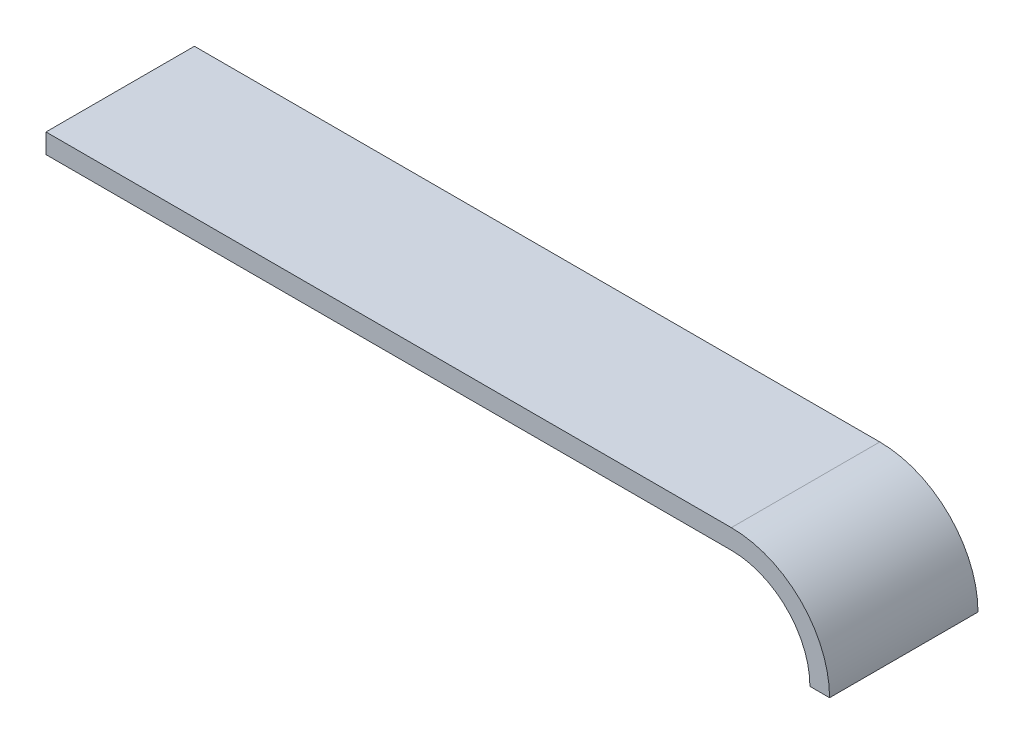
ISO-10303-21;
HEADER;
FILE_DESCRIPTION(('STEP AP214'),'2;1');
FILE_NAME('part.step','',(''),(''),'','','');
FILE_SCHEMA(('AUTOMOTIVE_DESIGN { 1 0 10303 214 1 1 1 1 }'));
ENDSEC;
DATA;
#1=APPLICATION_CONTEXT('core data for automotive mechanical design processes');
#2=APPLICATION_PROTOCOL_DEFINITION('international standard','automotive_design',2000,#1);
#3=PRODUCT_CONTEXT('',#1,'mechanical');
#4=PRODUCT('Part','Part','',(#3));
#5=PRODUCT_RELATED_PRODUCT_CATEGORY('part','',(#4));
#6=PRODUCT_DEFINITION_FORMATION('','',#4);
#7=PRODUCT_DEFINITION_CONTEXT('part definition',#1,'design');
#8=PRODUCT_DEFINITION('design','',#6,#7);
#9=PRODUCT_DEFINITION_SHAPE('','',#8);
#10=(LENGTH_UNIT() NAMED_UNIT(*) SI_UNIT(.MILLI.,.METRE.));
#11=(NAMED_UNIT(*) PLANE_ANGLE_UNIT() SI_UNIT($,.RADIAN.));
#12=(NAMED_UNIT(*) SI_UNIT($,.STERADIAN.) SOLID_ANGLE_UNIT());
#13=UNCERTAINTY_MEASURE_WITH_UNIT(LENGTH_MEASURE(1.E-05),#10,'distance_accuracy_value','');
#14=(GEOMETRIC_REPRESENTATION_CONTEXT(3) GLOBAL_UNCERTAINTY_ASSIGNED_CONTEXT((#13)) GLOBAL_UNIT_ASSIGNED_CONTEXT((#10,
#11,#12)) REPRESENTATION_CONTEXT('',''));
#15=CARTESIAN_POINT('',(0.,0.,0.));
#16=DIRECTION('',(0.,0.,1.));
#17=DIRECTION('',(1.,0.,0.));
#18=AXIS2_PLACEMENT_3D('',#15,#16,#17);
#19=CARTESIAN_POINT('',(-51.8867588788682,-4.70389551984832,17.));
#20=DIRECTION('',(1.,0.,0.));
#21=DIRECTION('',(0.,0.,-1.));
#22=AXIS2_PLACEMENT_3D('',#19,#20,#21);
#23=PLANE('',#22);
#24=DIRECTION('',(0.,-1.,0.));
#25=VECTOR('',#24,1.);
#26=CARTESIAN_POINT('',(-51.8867588788682,-4.70389551984832,0.));
#27=LINE('',#26,#25);
#28=CARTESIAN_POINT('',(-51.8867588788682,-4.70389551984832,0.));
#29=VERTEX_POINT('',#28);
#30=CARTESIAN_POINT('',(-51.8867588788682,-6.95389551984832,0.));
#31=VERTEX_POINT('',#30);
#32=EDGE_CURVE('E121',#29,#31,#27,.T.);
#33=ORIENTED_EDGE('',*,*,#32,.T.);
#34=DIRECTION('',(0.,0.,-1.));
#35=VECTOR('',#34,1.);
#36=CARTESIAN_POINT('',(-51.8867588788682,-6.95389551984832,17.));
#37=LINE('',#36,#35);
#38=CARTESIAN_POINT('',(-51.8867588788682,-6.95389551984832,17.));
#39=VERTEX_POINT('',#38);
#40=EDGE_CURVE('E11',#39,#31,#37,.T.);
#41=ORIENTED_EDGE('',*,*,#40,.F.);
#42=DIRECTION('',(0.,-1.,0.));
#43=VECTOR('',#42,1.);
#44=CARTESIAN_POINT('',(-51.8867588788682,-4.70389551984832,17.));
#45=LINE('',#44,#43);
#46=CARTESIAN_POINT('',(-51.8867588788682,-4.70389551984832,17.));
#47=VERTEX_POINT('',#46);
#48=EDGE_CURVE('E131',#47,#39,#45,.T.);
#49=ORIENTED_EDGE('',*,*,#48,.F.);
#50=DIRECTION('',(0.,0.,-1.));
#51=VECTOR('',#50,1.);
#52=CARTESIAN_POINT('',(-51.8867588788682,-4.70389551984832,17.));
#53=LINE('',#52,#51);
#54=EDGE_CURVE('E117',#47,#29,#53,.T.);
#55=ORIENTED_EDGE('',*,*,#54,.T.);
#56=EDGE_LOOP('',(#33,#41,#49,#55));
#57=FACE_BOUND('',#56,.T.);
#58=ADVANCED_FACE('F37',(#57),#23,.F.);
#59=CARTESIAN_POINT('',(-51.8867588788682,-6.95389551984832,17.));
#60=DIRECTION('',(0.,1.,0.));
#61=DIRECTION('',(0.,0.,1.));
#62=AXIS2_PLACEMENT_3D('',#59,#60,#61);
#63=PLANE('',#62);
#64=DIRECTION('',(1.,0.,0.));
#65=VECTOR('',#64,1.);
#66=CARTESIAN_POINT('',(-51.8867588788682,-6.95389551984832,0.));
#67=LINE('',#66,#65);
#68=CARTESIAN_POINT('',(26.6132411211318,-6.95389551984832,0.));
#69=VERTEX_POINT('',#68);
#70=EDGE_CURVE('E124',#31,#69,#67,.T.);
#71=ORIENTED_EDGE('',*,*,#70,.T.);
#72=DIRECTION('',(0.,0.,-1.));
#73=VECTOR('',#72,1.);
#74=CARTESIAN_POINT('',(26.6132411211318,-6.95389551984832,17.));
#75=LINE('',#74,#73);
#76=CARTESIAN_POINT('',(26.6132411211318,-6.95389551984832,17.));
#77=VERTEX_POINT('',#76);
#78=EDGE_CURVE('E45',#77,#69,#75,.T.);
#79=ORIENTED_EDGE('',*,*,#78,.F.);
#80=DIRECTION('',(1.,0.,0.));
#81=VECTOR('',#80,1.);
#82=CARTESIAN_POINT('',(-51.8867588788682,-6.95389551984832,17.));
#83=LINE('',#82,#81);
#84=EDGE_CURVE('E90',#39,#77,#83,.T.);
#85=ORIENTED_EDGE('',*,*,#84,.F.);
#86=ORIENTED_EDGE('',*,*,#40,.T.);
#87=EDGE_LOOP('',(#71,#79,#85,#86));
#88=FACE_BOUND('',#87,.T.);
#89=ADVANCED_FACE('F155',(#88),#63,.F.);
#90=CARTESIAN_POINT('',(26.6132411211318,-15.9538955198483,17.));
#91=DIRECTION('',(0.,0.,-1.));
#92=DIRECTION('',(-1.,0.,0.));
#93=AXIS2_PLACEMENT_3D('',#90,#91,#92);
#94=CYLINDRICAL_SURFACE('',#93,9.);
#95=CARTESIAN_POINT('',(26.6132411211318,-15.9538955198483,0.));
#96=DIRECTION('',(0.,0.,-1.));
#97=DIRECTION('',(-1.,0.,0.));
#98=AXIS2_PLACEMENT_3D('',#95,#96,#97);
#99=CIRCLE('',#98,9.);
#100=CARTESIAN_POINT('',(35.6132411211318,-15.9538955198483,0.));
#101=VERTEX_POINT('',#100);
#102=EDGE_CURVE('E126',#69,#101,#99,.T.);
#103=ORIENTED_EDGE('',*,*,#102,.T.);
#104=DIRECTION('',(0.,0.,-1.));
#105=VECTOR('',#104,1.);
#106=CARTESIAN_POINT('',(35.6132411211318,-15.9538955198483,17.));
#107=LINE('',#106,#105);
#108=CARTESIAN_POINT('',(35.6132411211318,-15.9538955198483,17.));
#109=VERTEX_POINT('',#108);
#110=EDGE_CURVE('E112',#109,#101,#107,.T.);
#111=ORIENTED_EDGE('',*,*,#110,.F.);
#112=CARTESIAN_POINT('',(26.6132411211318,-15.9538955198483,17.));
#113=DIRECTION('',(0.,0.,-1.));
#114=DIRECTION('',(-1.,0.,0.));
#115=AXIS2_PLACEMENT_3D('',#112,#113,#114);
#116=CIRCLE('',#115,9.);
#117=EDGE_CURVE('E103',#77,#109,#116,.T.);
#118=ORIENTED_EDGE('',*,*,#117,.F.);
#119=ORIENTED_EDGE('',*,*,#78,.T.);
#120=EDGE_LOOP('',(#103,#111,#118,#119));
#121=FACE_BOUND('',#120,.T.);
#122=ADVANCED_FACE('F137',(#121),#94,.F.);
#123=CARTESIAN_POINT('',(35.6132411211318,-15.9538955198483,17.));
#124=DIRECTION('',(0.,1.,0.));
#125=DIRECTION('',(0.,0.,1.));
#126=AXIS2_PLACEMENT_3D('',#123,#124,#125);
#127=PLANE('',#126);
#128=DIRECTION('',(1.,0.,0.));
#129=VECTOR('',#128,1.);
#130=CARTESIAN_POINT('',(35.6132411211318,-15.9538955198483,0.));
#131=LINE('',#130,#129);
#132=CARTESIAN_POINT('',(37.8632411211318,-15.9538955198483,0.));
#133=VERTEX_POINT('',#132);
#134=EDGE_CURVE('E111',#101,#133,#131,.T.);
#135=ORIENTED_EDGE('',*,*,#134,.T.);
#136=DIRECTION('',(0.,0.,-1.));
#137=VECTOR('',#136,1.);
#138=CARTESIAN_POINT('',(37.8632411211318,-15.9538955198483,17.));
#139=LINE('',#138,#137);
#140=CARTESIAN_POINT('',(37.8632411211318,-15.9538955198483,17.));
#141=VERTEX_POINT('',#140);
#142=EDGE_CURVE('E108',#141,#133,#139,.T.);
#143=ORIENTED_EDGE('',*,*,#142,.F.);
#144=DIRECTION('',(1.,0.,0.));
#145=VECTOR('',#144,1.);
#146=CARTESIAN_POINT('',(35.6132411211318,-15.9538955198483,17.));
#147=LINE('',#146,#145);
#148=EDGE_CURVE('E97',#109,#141,#147,.T.);
#149=ORIENTED_EDGE('',*,*,#148,.F.);
#150=ORIENTED_EDGE('',*,*,#110,.T.);
#151=EDGE_LOOP('',(#135,#143,#149,#150));
#152=FACE_BOUND('',#151,.T.);
#153=ADVANCED_FACE('F109',(#152),#127,.F.);
#154=CARTESIAN_POINT('',(26.6132411211318,-15.9538955198483,17.));
#155=DIRECTION('',(0.,0.,-1.));
#156=DIRECTION('',(-1.,0.,0.));
#157=AXIS2_PLACEMENT_3D('',#154,#155,#156);
#158=CYLINDRICAL_SURFACE('',#157,11.25);
#159=CARTESIAN_POINT('',(26.6132411211318,-15.9538955198483,0.));
#160=DIRECTION('',(0.,0.,1.));
#161=DIRECTION('',(-1.,0.,0.));
#162=AXIS2_PLACEMENT_3D('',#159,#160,#161);
#163=CIRCLE('',#162,11.25);
#164=CARTESIAN_POINT('',(26.6132411211318,-4.70389551984832,0.));
#165=VERTEX_POINT('',#164);
#166=EDGE_CURVE('E76',#133,#165,#163,.T.);
#167=ORIENTED_EDGE('',*,*,#166,.T.);
#168=DIRECTION('',(0.,0.,-1.));
#169=VECTOR('',#168,1.);
#170=CARTESIAN_POINT('',(26.6132411211318,-4.70389551984832,17.));
#171=LINE('',#170,#169);
#172=CARTESIAN_POINT('',(26.6132411211318,-4.70389551984832,17.));
#173=VERTEX_POINT('',#172);
#174=EDGE_CURVE('E113',#173,#165,#171,.T.);
#175=ORIENTED_EDGE('',*,*,#174,.F.);
#176=CARTESIAN_POINT('',(26.6132411211318,-15.9538955198483,17.));
#177=DIRECTION('',(0.,0.,1.));
#178=DIRECTION('',(-1.,0.,0.));
#179=AXIS2_PLACEMENT_3D('',#176,#177,#178);
#180=CIRCLE('',#179,11.25);
#181=EDGE_CURVE('E101',#141,#173,#180,.T.);
#182=ORIENTED_EDGE('',*,*,#181,.F.);
#183=ORIENTED_EDGE('',*,*,#142,.T.);
#184=EDGE_LOOP('',(#167,#175,#182,#183));
#185=FACE_BOUND('',#184,.T.);
#186=ADVANCED_FACE('F115',(#185),#158,.T.);
#187=CARTESIAN_POINT('',(-51.8867588788682,-4.70389551984832,17.));
#188=DIRECTION('',(0.,-1.,0.));
#189=DIRECTION('',(0.,0.,-1.));
#190=AXIS2_PLACEMENT_3D('',#187,#188,#189);
#191=PLANE('',#190);
#192=DIRECTION('',(-1.,0.,0.));
#193=VECTOR('',#192,1.);
#194=CARTESIAN_POINT('',(-51.8867588788682,-4.70389551984832,0.));
#195=LINE('',#194,#193);
#196=EDGE_CURVE('E82',#165,#29,#195,.T.);
#197=ORIENTED_EDGE('',*,*,#196,.T.);
#198=ORIENTED_EDGE('',*,*,#54,.F.);
#199=DIRECTION('',(-1.,0.,0.));
#200=VECTOR('',#199,1.);
#201=CARTESIAN_POINT('',(-51.8867588788682,-4.70389551984832,17.));
#202=LINE('',#201,#200);
#203=EDGE_CURVE('E53',#173,#47,#202,.T.);
#204=ORIENTED_EDGE('',*,*,#203,.F.);
#205=ORIENTED_EDGE('',*,*,#174,.T.);
#206=EDGE_LOOP('',(#197,#198,#204,#205));
#207=FACE_BOUND('',#206,.T.);
#208=ADVANCED_FACE('F144',(#207),#191,.F.);
#209=CARTESIAN_POINT('',(26.6132411211318,-15.9538955198483,17.));
#210=DIRECTION('',(0.,0.,-1.));
#211=DIRECTION('',(-1.,0.,0.));
#212=AXIS2_PLACEMENT_3D('',#209,#210,#211);
#213=PLANE('',#212);
#214=ORIENTED_EDGE('',*,*,#48,.T.);
#215=ORIENTED_EDGE('',*,*,#84,.T.);
#216=ORIENTED_EDGE('',*,*,#117,.T.);
#217=ORIENTED_EDGE('',*,*,#148,.T.);
#218=ORIENTED_EDGE('',*,*,#181,.T.);
#219=ORIENTED_EDGE('',*,*,#203,.T.);
#220=EDGE_LOOP('',(#214,#215,#216,#217,#218,#219));
#221=FACE_BOUND('',#220,.T.);
#222=ADVANCED_FACE('F99',(#221),#213,.F.);
#223=CARTESIAN_POINT('',(26.6132411211318,-15.9538955198483,0.));
#224=DIRECTION('',(0.,0.,-1.));
#225=DIRECTION('',(-1.,0.,0.));
#226=AXIS2_PLACEMENT_3D('',#223,#224,#225);
#227=PLANE('',#226);
#228=ORIENTED_EDGE('',*,*,#32,.F.);
#229=ORIENTED_EDGE('',*,*,#196,.F.);
#230=ORIENTED_EDGE('',*,*,#166,.F.);
#231=ORIENTED_EDGE('',*,*,#134,.F.);
#232=ORIENTED_EDGE('',*,*,#102,.F.);
#233=ORIENTED_EDGE('',*,*,#70,.F.);
#234=EDGE_LOOP('',(#228,#229,#230,#231,#232,#233));
#235=FACE_BOUND('',#234,.T.);
#236=ADVANCED_FACE('F140',(#235),#227,.T.);
#237=CLOSED_SHELL('',(#58,#89,#122,#153,#186,#208,#222,#236));
#238=MANIFOLD_SOLID_BREP('B2',#237);
#239=ADVANCED_BREP_SHAPE_REPRESENTATION('',(#18,#238),#14);
#240=SHAPE_DEFINITION_REPRESENTATION(#9,#239);
ENDSEC;
END-ISO-10303-21;
